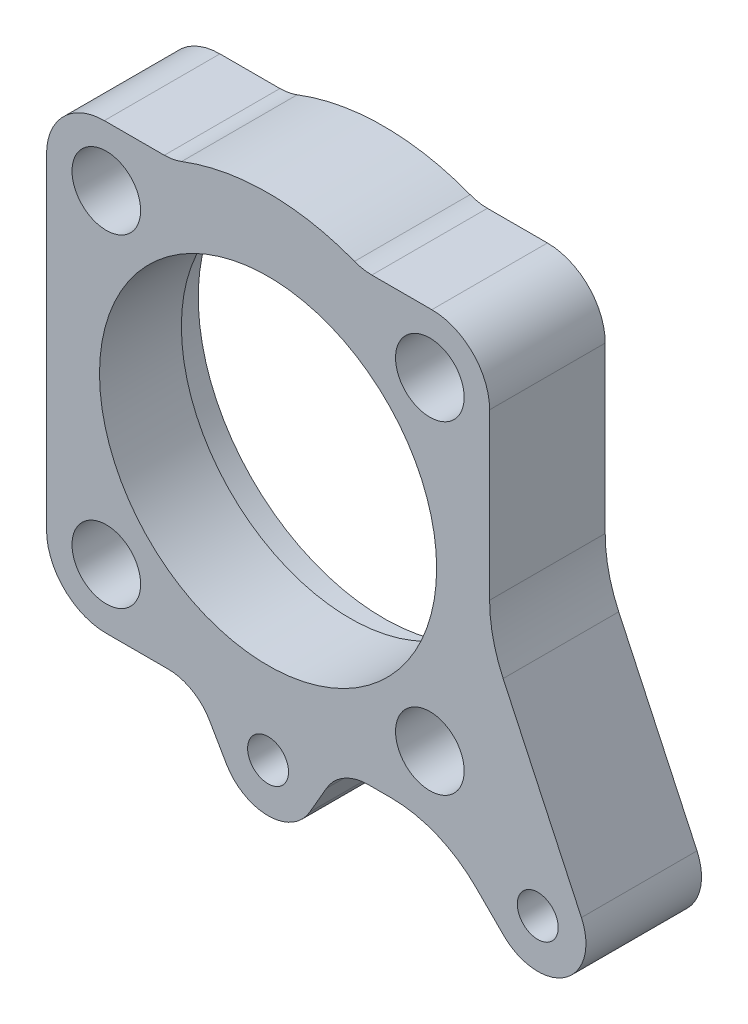
ISO-10303-21;
HEADER;
FILE_DESCRIPTION(('STEP AP214'),'2;1');
FILE_NAME('part.step','',(''),(''),'','','');
FILE_SCHEMA(('AUTOMOTIVE_DESIGN { 1 0 10303 214 1 1 1 1 }'));
ENDSEC;
DATA;
#1=APPLICATION_CONTEXT('core data for automotive mechanical design processes');
#2=APPLICATION_PROTOCOL_DEFINITION('international standard','automotive_design',2000,#1);
#3=PRODUCT_CONTEXT('',#1,'mechanical');
#4=PRODUCT('Part','Part','',(#3));
#5=PRODUCT_RELATED_PRODUCT_CATEGORY('part','',(#4));
#6=PRODUCT_DEFINITION_FORMATION('','',#4);
#7=PRODUCT_DEFINITION_CONTEXT('part definition',#1,'design');
#8=PRODUCT_DEFINITION('design','',#6,#7);
#9=PRODUCT_DEFINITION_SHAPE('','',#8);
#10=(LENGTH_UNIT() NAMED_UNIT(*) SI_UNIT(.MILLI.,.METRE.));
#11=(NAMED_UNIT(*) PLANE_ANGLE_UNIT() SI_UNIT($,.RADIAN.));
#12=(NAMED_UNIT(*) SI_UNIT($,.STERADIAN.) SOLID_ANGLE_UNIT());
#13=UNCERTAINTY_MEASURE_WITH_UNIT(LENGTH_MEASURE(1.E-05),#10,'distance_accuracy_value','');
#14=(GEOMETRIC_REPRESENTATION_CONTEXT(3) GLOBAL_UNCERTAINTY_ASSIGNED_CONTEXT((#13)) GLOBAL_UNIT_ASSIGNED_CONTEXT((#10,
#11,#12)) REPRESENTATION_CONTEXT('',''));
#15=CARTESIAN_POINT('',(0.,0.,0.));
#16=DIRECTION('',(0.,0.,1.));
#17=DIRECTION('',(1.,0.,0.));
#18=AXIS2_PLACEMENT_3D('',#15,#16,#17);
#19=CARTESIAN_POINT('',(0.,-52.,12.));
#20=DIRECTION('',(0.,0.,-1.));
#21=DIRECTION('',(-1.,0.,0.));
#22=AXIS2_PLACEMENT_3D('',#19,#20,#21);
#23=PLANE('',#22);
#24=CARTESIAN_POINT('',(-33.5875721063608,33.5875721063612,12.));
#25=DIRECTION('',(0.,0.,1.));
#26=DIRECTION('',(1.,0.,0.));
#27=AXIS2_PLACEMENT_3D('',#24,#25,#26);
#28=CIRCLE('',#27,7.125);
#29=CARTESIAN_POINT('',(-26.4625721063608,33.5875721063612,12.));
#30=VERTEX_POINT('',#29);
#31=EDGE_CURVE('E655',#30,#30,#28,.T.);
#32=ORIENTED_EDGE('',*,*,#31,.F.);
#33=EDGE_LOOP('',(#32));
#34=FACE_BOUND('',#33,.T.);
#35=CARTESIAN_POINT('',(-33.5875721063608,-33.5875721063612,12.));
#36=DIRECTION('',(0.,0.,1.));
#37=DIRECTION('',(1.,0.,0.));
#38=AXIS2_PLACEMENT_3D('',#35,#36,#37);
#39=CIRCLE('',#38,7.125);
#40=CARTESIAN_POINT('',(-26.4625721063608,-33.5875721063612,12.));
#41=VERTEX_POINT('',#40);
#42=EDGE_CURVE('E657',#41,#41,#39,.T.);
#43=ORIENTED_EDGE('',*,*,#42,.F.);
#44=EDGE_LOOP('',(#43));
#45=FACE_BOUND('',#44,.T.);
#46=CARTESIAN_POINT('',(33.5875721063608,-33.5875721063612,12.));
#47=DIRECTION('',(0.,0.,1.));
#48=DIRECTION('',(1.,0.,0.));
#49=AXIS2_PLACEMENT_3D('',#46,#47,#48);
#50=CIRCLE('',#49,7.125);
#51=CARTESIAN_POINT('',(40.7125721063608,-33.5875721063612,12.));
#52=VERTEX_POINT('',#51);
#53=EDGE_CURVE('E663',#52,#52,#50,.T.);
#54=ORIENTED_EDGE('',*,*,#53,.F.);
#55=EDGE_LOOP('',(#54));
#56=FACE_BOUND('',#55,.T.);
#57=CARTESIAN_POINT('',(33.5875721063607,33.5875721063613,12.));
#58=DIRECTION('',(0.,0.,1.));
#59=DIRECTION('',(1.,0.,0.));
#60=AXIS2_PLACEMENT_3D('',#57,#58,#59);
#61=CIRCLE('',#60,7.12500000000001);
#62=CARTESIAN_POINT('',(40.7125721063607,33.5875721063613,12.));
#63=VERTEX_POINT('',#62);
#64=EDGE_CURVE('E669',#63,#63,#61,.T.);
#65=ORIENTED_EDGE('',*,*,#64,.F.);
#66=EDGE_LOOP('',(#65));
#67=FACE_BOUND('',#66,.T.);
#68=CARTESIAN_POINT('',(56.,-52.,12.));
#69=DIRECTION('',(0.,0.,1.));
#70=DIRECTION('',(1.,0.,0.));
#71=AXIS2_PLACEMENT_3D('',#68,#69,#70);
#72=CIRCLE('',#71,4.25);
#73=CARTESIAN_POINT('',(60.25,-52.,12.));
#74=VERTEX_POINT('',#73);
#75=EDGE_CURVE('E675',#74,#74,#72,.T.);
#76=ORIENTED_EDGE('',*,*,#75,.F.);
#77=EDGE_LOOP('',(#76));
#78=FACE_BOUND('',#77,.T.);
#79=CARTESIAN_POINT('',(0.,-52.,12.));
#80=DIRECTION('',(0.,0.,1.));
#81=DIRECTION('',(1.,0.,0.));
#82=AXIS2_PLACEMENT_3D('',#79,#80,#81);
#83=CIRCLE('',#82,4.25);
#84=CARTESIAN_POINT('',(4.25000000000001,-52.,12.));
#85=VERTEX_POINT('',#84);
#86=EDGE_CURVE('E683',#85,#85,#83,.T.);
#87=ORIENTED_EDGE('',*,*,#86,.F.);
#88=EDGE_LOOP('',(#87));
#89=FACE_BOUND('',#88,.T.);
#90=CARTESIAN_POINT('',(0.,-52.,12.));
#91=DIRECTION('',(0.,0.,-1.));
#92=DIRECTION('',(-1.,0.,0.));
#93=AXIS2_PLACEMENT_3D('',#90,#91,#92);
#94=CIRCLE('',#93,10.);
#95=CARTESIAN_POINT('',(8.66025403784439,-57.,12.));
#96=VERTEX_POINT('',#95);
#97=CARTESIAN_POINT('',(-8.66025403784436,-57.,12.));
#98=VERTEX_POINT('',#97);
#99=EDGE_CURVE('E284',#96,#98,#94,.T.);
#100=ORIENTED_EDGE('',*,*,#99,.F.);
#101=DIRECTION('',(0.5,0.866025403784439,0.));
#102=VECTOR('',#101,1.);
#103=CARTESIAN_POINT('',(8.66025403784439,-57.,12.));
#104=LINE('',#103,#102);
#105=CARTESIAN_POINT('',(12.1243556529819,-51.0000000000005,12.));
#106=VERTEX_POINT('',#105);
#107=EDGE_CURVE('E216',#96,#106,#104,.T.);
#108=ORIENTED_EDGE('',*,*,#107,.T.);
#109=CARTESIAN_POINT('',(20.7846096908263,-56.0000000000005,12.));
#110=DIRECTION('',(0.,0.,1.));
#111=DIRECTION('',(1.,0.,0.));
#112=AXIS2_PLACEMENT_3D('',#109,#110,#111);
#113=CIRCLE('',#112,10.);
#114=CARTESIAN_POINT('',(20.7846096908263,-46.0000000000005,12.));
#115=VERTEX_POINT('',#114);
#116=EDGE_CURVE('E202',#115,#106,#113,.T.);
#117=ORIENTED_EDGE('',*,*,#116,.F.);
#118=DIRECTION('',(-1.,0.,0.));
#119=VECTOR('',#118,1.);
#120=CARTESIAN_POINT('',(25.5025253169422,-46.0000000000006,12.));
#121=LINE('',#120,#119);
#122=CARTESIAN_POINT('',(25.5025253169422,-46.0000000000006,12.));
#123=VERTEX_POINT('',#122);
#124=EDGE_CURVE('E215',#123,#115,#121,.T.);
#125=ORIENTED_EDGE('',*,*,#124,.F.);
#126=CARTESIAN_POINT('',(25.5025253169423,-71.0000000000006,12.));
#127=DIRECTION('',(0.,0.,-1.));
#128=DIRECTION('',(-1.,0.,0.));
#129=AXIS2_PLACEMENT_3D('',#126,#127,#128);
#130=CIRCLE('',#129,25.);
#131=CARTESIAN_POINT('',(43.1801948466059,-53.3223304703368,12.));
#132=VERTEX_POINT('',#131);
#133=EDGE_CURVE('E220',#123,#132,#130,.T.);
#134=ORIENTED_EDGE('',*,*,#133,.T.);
#135=DIRECTION('',(-0.707106781186552,0.707106781186543,0.));
#136=VECTOR('',#135,1.);
#137=CARTESIAN_POINT('',(48.9289321881346,-59.0710678118655,12.));
#138=LINE('',#137,#136);
#139=CARTESIAN_POINT('',(48.9289321881346,-59.0710678118655,12.));
#140=VERTEX_POINT('',#139);
#141=EDGE_CURVE('E222',#140,#132,#138,.T.);
#142=ORIENTED_EDGE('',*,*,#141,.F.);
#143=CARTESIAN_POINT('',(56.,-52.,12.));
#144=DIRECTION('',(0.,0.,-1.));
#145=DIRECTION('',(-1.,0.,0.));
#146=AXIS2_PLACEMENT_3D('',#143,#144,#145);
#147=CIRCLE('',#146,10.);
#148=CARTESIAN_POINT('',(65.0630778703665,-47.773817382593,12.));
#149=VERTEX_POINT('',#148);
#150=EDGE_CURVE('E371',#149,#140,#147,.T.);
#151=ORIENTED_EDGE('',*,*,#150,.F.);
#152=DIRECTION('',(-0.422618261740704,0.906307787036648,0.));
#153=VECTOR('',#152,1.);
#154=CARTESIAN_POINT('',(65.0630778703665,-47.773817382593,12.));
#155=LINE('',#154,#153);
#156=CARTESIAN_POINT('',(48.8107663889006,-12.9206229363128,12.));
#157=VERTEX_POINT('',#156);
#158=EDGE_CURVE('E369',#149,#157,#155,.T.);
#159=ORIENTED_EDGE('',*,*,#158,.T.);
#160=CARTESIAN_POINT('',(76.,-0.242075084091728,12.));
#161=DIRECTION('',(0.,0.,1.));
#162=DIRECTION('',(1.,0.,0.));
#163=AXIS2_PLACEMENT_3D('',#160,#161,#162);
#164=CIRCLE('',#163,30.);
#165=CARTESIAN_POINT('',(46.,-0.242075084091724,12.));
#166=VERTEX_POINT('',#165);
#167=EDGE_CURVE('E366',#166,#157,#164,.T.);
#168=ORIENTED_EDGE('',*,*,#167,.F.);
#169=DIRECTION('',(0.,-1.,0.));
#170=VECTOR('',#169,1.);
#171=CARTESIAN_POINT('',(46.,34.,12.));
#172=LINE('',#171,#170);
#173=CARTESIAN_POINT('',(46.,34.,12.));
#174=VERTEX_POINT('',#173);
#175=EDGE_CURVE('E363',#174,#166,#172,.T.);
#176=ORIENTED_EDGE('',*,*,#175,.F.);
#177=CARTESIAN_POINT('',(34.,34.,12.));
#178=DIRECTION('',(0.,0.,1.));
#179=DIRECTION('',(1.,0.,0.));
#180=AXIS2_PLACEMENT_3D('',#177,#178,#179);
#181=CIRCLE('',#180,12.);
#182=CARTESIAN_POINT('',(34.,46.,12.));
#183=VERTEX_POINT('',#182);
#184=EDGE_CURVE('E361',#174,#183,#181,.T.);
#185=ORIENTED_EDGE('',*,*,#184,.T.);
#186=DIRECTION('',(-1.,0.,0.));
#187=VECTOR('',#186,1.);
#188=CARTESIAN_POINT('',(34.,46.,12.));
#189=LINE('',#188,#187);
#190=CARTESIAN_POINT('',(21.5406592285381,46.,12.));
#191=VERTEX_POINT('',#190);
#192=EDGE_CURVE('E359',#183,#191,#189,.T.);
#193=ORIENTED_EDGE('',*,*,#192,.T.);
#194=CARTESIAN_POINT('',(21.5406592285381,56.,12.));
#195=DIRECTION('',(0.,0.,1.));
#196=DIRECTION('',(1.,0.,0.));
#197=AXIS2_PLACEMENT_3D('',#194,#195,#196);
#198=CIRCLE('',#197,9.99999999999999);
#199=CARTESIAN_POINT('',(17.950549357115,46.6666666666667,12.));
#200=VERTEX_POINT('',#199);
#201=EDGE_CURVE('E356',#200,#191,#198,.T.);
#202=ORIENTED_EDGE('',*,*,#201,.F.);
#203=CARTESIAN_POINT('',(0.,0.,12.));
#204=DIRECTION('',(0.,0.,1.));
#205=DIRECTION('',(1.,0.,0.));
#206=AXIS2_PLACEMENT_3D('',#203,#204,#205);
#207=CIRCLE('',#206,50.);
#208=CARTESIAN_POINT('',(-17.950549357115,46.6666666666667,12.));
#209=VERTEX_POINT('',#208);
#210=EDGE_CURVE('E354',#200,#209,#207,.T.);
#211=ORIENTED_EDGE('',*,*,#210,.T.);
#212=CARTESIAN_POINT('',(-21.5406592285381,56.,12.));
#213=DIRECTION('',(0.,0.,-1.));
#214=DIRECTION('',(-1.,0.,0.));
#215=AXIS2_PLACEMENT_3D('',#212,#213,#214);
#216=CIRCLE('',#215,9.99999999999999);
#217=CARTESIAN_POINT('',(-21.540659228538,46.,12.));
#218=VERTEX_POINT('',#217);
#219=EDGE_CURVE('E352',#209,#218,#216,.T.);
#220=ORIENTED_EDGE('',*,*,#219,.T.);
#221=DIRECTION('',(1.,0.,0.));
#222=VECTOR('',#221,1.);
#223=CARTESIAN_POINT('',(-34.,46.,12.));
#224=LINE('',#223,#222);
#225=CARTESIAN_POINT('',(-34.,46.,12.));
#226=VERTEX_POINT('',#225);
#227=EDGE_CURVE('E349',#226,#218,#224,.T.);
#228=ORIENTED_EDGE('',*,*,#227,.F.);
#229=CARTESIAN_POINT('',(-34.,34.,12.));
#230=DIRECTION('',(0.,0.,-1.));
#231=DIRECTION('',(-1.,0.,0.));
#232=AXIS2_PLACEMENT_3D('',#229,#230,#231);
#233=CIRCLE('',#232,12.);
#234=CARTESIAN_POINT('',(-46.,34.,12.));
#235=VERTEX_POINT('',#234);
#236=EDGE_CURVE('E346',#235,#226,#233,.T.);
#237=ORIENTED_EDGE('',*,*,#236,.F.);
#238=DIRECTION('',(0.,1.,0.));
#239=VECTOR('',#238,1.);
#240=CARTESIAN_POINT('',(-46.,-33.5875721063613,12.));
#241=LINE('',#240,#239);
#242=CARTESIAN_POINT('',(-46.,-33.5875721063613,12.));
#243=VERTEX_POINT('',#242);
#244=EDGE_CURVE('E344',#243,#235,#241,.T.);
#245=ORIENTED_EDGE('',*,*,#244,.F.);
#246=CARTESIAN_POINT('',(-33.5875721063608,-33.5875721063612,12.));
#247=DIRECTION('',(0.,0.,1.));
#248=DIRECTION('',(1.,0.,0.));
#249=AXIS2_PLACEMENT_3D('',#246,#247,#248);
#250=CIRCLE('',#249,12.4124278936392);
#251=CARTESIAN_POINT('',(-33.5875721063607,-46.0000000000004,12.));
#252=VERTEX_POINT('',#251);
#253=EDGE_CURVE('E342',#243,#252,#250,.T.);
#254=ORIENTED_EDGE('',*,*,#253,.T.);
#255=DIRECTION('',(1.,0.,0.));
#256=VECTOR('',#255,1.);
#257=CARTESIAN_POINT('',(-33.5875721063607,-46.0000000000005,12.));
#258=LINE('',#257,#256);
#259=CARTESIAN_POINT('',(-20.7846096908262,-46.0000000000005,12.));
#260=VERTEX_POINT('',#259);
#261=EDGE_CURVE('E340',#252,#260,#258,.T.);
#262=ORIENTED_EDGE('',*,*,#261,.T.);
#263=CARTESIAN_POINT('',(-20.7846096908262,-56.0000000000005,12.));
#264=DIRECTION('',(0.,0.,-1.));
#265=DIRECTION('',(-1.,0.,0.));
#266=AXIS2_PLACEMENT_3D('',#263,#264,#265);
#267=CIRCLE('',#266,9.99999999999997);
#268=CARTESIAN_POINT('',(-12.1243556529819,-51.0000000000005,12.));
#269=VERTEX_POINT('',#268);
#270=EDGE_CURVE('E334',#260,#269,#267,.T.);
#271=ORIENTED_EDGE('',*,*,#270,.T.);
#272=DIRECTION('',(-0.500000000000001,0.866025403784438,0.));
#273=VECTOR('',#272,1.);
#274=CARTESIAN_POINT('',(-8.66025403784436,-57.,12.));
#275=LINE('',#274,#273);
#276=EDGE_CURVE('E332',#98,#269,#275,.T.);
#277=ORIENTED_EDGE('',*,*,#276,.F.);
#278=EDGE_LOOP('',(#100,#108,#117,#125,#134,#142,#151,#159,#168,#176,#185,#193,#202,#211,#220,
#228,#237,#245,#254,#262,#271,#277));
#279=FACE_BOUND('',#278,.T.);
#280=CARTESIAN_POINT('',(0.,0.,12.));
#281=DIRECTION('',(0.,0.,1.));
#282=DIRECTION('',(1.,0.,0.));
#283=AXIS2_PLACEMENT_3D('',#280,#281,#282);
#284=CIRCLE('',#283,35.);
#285=CARTESIAN_POINT('',(35.,0.,12.));
#286=VERTEX_POINT('',#285);
#287=EDGE_CURVE('E231',#286,#286,#284,.T.);
#288=ORIENTED_EDGE('',*,*,#287,.F.);
#289=EDGE_LOOP('',(#288));
#290=FACE_BOUND('',#289,.T.);
#291=ADVANCED_FACE('F45',(#34,#45,#56,#67,#78,#89,#279,#290),#23,.F.);
#292=CARTESIAN_POINT('',(0.,-52.,-12.));
#293=DIRECTION('',(0.,0.,-1.));
#294=DIRECTION('',(-1.,0.,0.));
#295=AXIS2_PLACEMENT_3D('',#292,#293,#294);
#296=PLANE('',#295);
#297=CARTESIAN_POINT('',(-33.5875721063608,33.5875721063612,-12.));
#298=DIRECTION('',(0.,0.,1.));
#299=DIRECTION('',(1.,0.,0.));
#300=AXIS2_PLACEMENT_3D('',#297,#298,#299);
#301=CIRCLE('',#300,7.125);
#302=CARTESIAN_POINT('',(-26.4625721063608,33.5875721063612,-12.));
#303=VERTEX_POINT('',#302);
#304=EDGE_CURVE('E653',#303,#303,#301,.T.);
#305=ORIENTED_EDGE('',*,*,#304,.T.);
#306=EDGE_LOOP('',(#305));
#307=FACE_BOUND('',#306,.T.);
#308=CARTESIAN_POINT('',(-33.5875721063608,-33.5875721063612,-12.));
#309=DIRECTION('',(0.,0.,1.));
#310=DIRECTION('',(1.,0.,0.));
#311=AXIS2_PLACEMENT_3D('',#308,#309,#310);
#312=CIRCLE('',#311,7.125);
#313=CARTESIAN_POINT('',(-26.4625721063608,-33.5875721063612,-12.));
#314=VERTEX_POINT('',#313);
#315=EDGE_CURVE('E660',#314,#314,#312,.T.);
#316=ORIENTED_EDGE('',*,*,#315,.T.);
#317=EDGE_LOOP('',(#316));
#318=FACE_BOUND('',#317,.T.);
#319=CARTESIAN_POINT('',(33.5875721063608,-33.5875721063612,-12.));
#320=DIRECTION('',(0.,0.,1.));
#321=DIRECTION('',(1.,0.,0.));
#322=AXIS2_PLACEMENT_3D('',#319,#320,#321);
#323=CIRCLE('',#322,7.125);
#324=CARTESIAN_POINT('',(40.7125721063608,-33.5875721063612,-12.));
#325=VERTEX_POINT('',#324);
#326=EDGE_CURVE('E666',#325,#325,#323,.T.);
#327=ORIENTED_EDGE('',*,*,#326,.T.);
#328=EDGE_LOOP('',(#327));
#329=FACE_BOUND('',#328,.T.);
#330=CARTESIAN_POINT('',(33.5875721063607,33.5875721063613,-12.));
#331=DIRECTION('',(0.,0.,1.));
#332=DIRECTION('',(1.,0.,0.));
#333=AXIS2_PLACEMENT_3D('',#330,#331,#332);
#334=CIRCLE('',#333,7.12500000000001);
#335=CARTESIAN_POINT('',(40.7125721063607,33.5875721063613,-12.));
#336=VERTEX_POINT('',#335);
#337=EDGE_CURVE('E672',#336,#336,#334,.T.);
#338=ORIENTED_EDGE('',*,*,#337,.T.);
#339=EDGE_LOOP('',(#338));
#340=FACE_BOUND('',#339,.T.);
#341=CARTESIAN_POINT('',(56.,-52.,-12.));
#342=DIRECTION('',(0.,0.,1.));
#343=DIRECTION('',(1.,0.,0.));
#344=AXIS2_PLACEMENT_3D('',#341,#342,#343);
#345=CIRCLE('',#344,4.25);
#346=CARTESIAN_POINT('',(60.25,-52.,-12.));
#347=VERTEX_POINT('',#346);
#348=EDGE_CURVE('E680',#347,#347,#345,.T.);
#349=ORIENTED_EDGE('',*,*,#348,.T.);
#350=EDGE_LOOP('',(#349));
#351=FACE_BOUND('',#350,.T.);
#352=CARTESIAN_POINT('',(0.,-52.,-12.));
#353=DIRECTION('',(0.,0.,1.));
#354=DIRECTION('',(1.,0.,0.));
#355=AXIS2_PLACEMENT_3D('',#352,#353,#354);
#356=CIRCLE('',#355,4.25);
#357=CARTESIAN_POINT('',(4.25000000000001,-52.,-12.));
#358=VERTEX_POINT('',#357);
#359=EDGE_CURVE('E686',#358,#358,#356,.T.);
#360=ORIENTED_EDGE('',*,*,#359,.T.);
#361=EDGE_LOOP('',(#360));
#362=FACE_BOUND('',#361,.T.);
#363=CARTESIAN_POINT('',(0.,-52.,-12.));
#364=DIRECTION('',(0.,0.,-1.));
#365=DIRECTION('',(-1.,0.,0.));
#366=AXIS2_PLACEMENT_3D('',#363,#364,#365);
#367=CIRCLE('',#366,10.);
#368=CARTESIAN_POINT('',(8.66025403784439,-57.,-12.));
#369=VERTEX_POINT('',#368);
#370=CARTESIAN_POINT('',(-8.66025403784436,-57.,-12.));
#371=VERTEX_POINT('',#370);
#372=EDGE_CURVE('E227',#369,#371,#367,.T.);
#373=ORIENTED_EDGE('',*,*,#372,.T.);
#374=DIRECTION('',(-0.500000000000001,0.866025403784438,0.));
#375=VECTOR('',#374,1.);
#376=CARTESIAN_POINT('',(-8.66025403784436,-57.,-12.));
#377=LINE('',#376,#375);
#378=CARTESIAN_POINT('',(-12.1243556529819,-51.0000000000005,-12.));
#379=VERTEX_POINT('',#378);
#380=EDGE_CURVE('E230',#371,#379,#377,.T.);
#381=ORIENTED_EDGE('',*,*,#380,.T.);
#382=CARTESIAN_POINT('',(-20.7846096908262,-56.0000000000005,-12.));
#383=DIRECTION('',(0.,0.,-1.));
#384=DIRECTION('',(-1.,0.,0.));
#385=AXIS2_PLACEMENT_3D('',#382,#383,#384);
#386=CIRCLE('',#385,9.99999999999997);
#387=CARTESIAN_POINT('',(-20.7846096908262,-46.0000000000005,-12.));
#388=VERTEX_POINT('',#387);
#389=EDGE_CURVE('E234',#388,#379,#386,.T.);
#390=ORIENTED_EDGE('',*,*,#389,.F.);
#391=DIRECTION('',(1.,0.,0.));
#392=VECTOR('',#391,1.);
#393=CARTESIAN_POINT('',(-33.5875721063607,-46.0000000000005,-12.));
#394=LINE('',#393,#392);
#395=CARTESIAN_POINT('',(-33.5875721063607,-46.0000000000004,-12.));
#396=VERTEX_POINT('',#395);
#397=EDGE_CURVE('E237',#396,#388,#394,.T.);
#398=ORIENTED_EDGE('',*,*,#397,.F.);
#399=CARTESIAN_POINT('',(-33.5875721063608,-33.5875721063612,-12.));
#400=DIRECTION('',(0.,0.,1.));
#401=DIRECTION('',(1.,0.,0.));
#402=AXIS2_PLACEMENT_3D('',#399,#400,#401);
#403=CIRCLE('',#402,12.4124278936392);
#404=CARTESIAN_POINT('',(-46.,-33.5875721063613,-12.));
#405=VERTEX_POINT('',#404);
#406=EDGE_CURVE('E239',#405,#396,#403,.T.);
#407=ORIENTED_EDGE('',*,*,#406,.F.);
#408=DIRECTION('',(0.,-1.,0.));
#409=VECTOR('',#408,1.);
#410=CARTESIAN_POINT('',(-46.,34.,-12.));
#411=LINE('',#410,#409);
#412=CARTESIAN_POINT('',(-46.,34.,-12.));
#413=VERTEX_POINT('',#412);
#414=EDGE_CURVE('E241',#413,#405,#411,.T.);
#415=ORIENTED_EDGE('',*,*,#414,.F.);
#416=CARTESIAN_POINT('',(-34.,34.,-12.));
#417=DIRECTION('',(0.,0.,-1.));
#418=DIRECTION('',(-1.,0.,0.));
#419=AXIS2_PLACEMENT_3D('',#416,#417,#418);
#420=CIRCLE('',#419,12.);
#421=CARTESIAN_POINT('',(-34.,46.,-12.));
#422=VERTEX_POINT('',#421);
#423=EDGE_CURVE('E243',#413,#422,#420,.T.);
#424=ORIENTED_EDGE('',*,*,#423,.T.);
#425=DIRECTION('',(1.,0.,0.));
#426=VECTOR('',#425,1.);
#427=CARTESIAN_POINT('',(-34.,46.,-12.));
#428=LINE('',#427,#426);
#429=CARTESIAN_POINT('',(-21.540659228538,46.,-12.));
#430=VERTEX_POINT('',#429);
#431=EDGE_CURVE('E246',#422,#430,#428,.T.);
#432=ORIENTED_EDGE('',*,*,#431,.T.);
#433=CARTESIAN_POINT('',(-21.5406592285381,56.,-12.));
#434=DIRECTION('',(0.,0.,-1.));
#435=DIRECTION('',(-1.,0.,0.));
#436=AXIS2_PLACEMENT_3D('',#433,#434,#435);
#437=CIRCLE('',#436,9.99999999999999);
#438=CARTESIAN_POINT('',(-17.950549357115,46.6666666666667,-12.));
#439=VERTEX_POINT('',#438);
#440=EDGE_CURVE('E249',#439,#430,#437,.T.);
#441=ORIENTED_EDGE('',*,*,#440,.F.);
#442=CARTESIAN_POINT('',(0.,0.,-12.));
#443=DIRECTION('',(0.,0.,1.));
#444=DIRECTION('',(1.,0.,0.));
#445=AXIS2_PLACEMENT_3D('',#442,#443,#444);
#446=CIRCLE('',#445,50.);
#447=CARTESIAN_POINT('',(17.950549357115,46.6666666666667,-12.));
#448=VERTEX_POINT('',#447);
#449=EDGE_CURVE('E252',#448,#439,#446,.T.);
#450=ORIENTED_EDGE('',*,*,#449,.F.);
#451=CARTESIAN_POINT('',(21.5406592285381,56.,-12.));
#452=DIRECTION('',(0.,0.,1.));
#453=DIRECTION('',(1.,0.,0.));
#454=AXIS2_PLACEMENT_3D('',#451,#452,#453);
#455=CIRCLE('',#454,9.99999999999999);
#456=CARTESIAN_POINT('',(21.5406592285381,46.,-12.));
#457=VERTEX_POINT('',#456);
#458=EDGE_CURVE('E254',#448,#457,#455,.T.);
#459=ORIENTED_EDGE('',*,*,#458,.T.);
#460=DIRECTION('',(-1.,0.,0.));
#461=VECTOR('',#460,1.);
#462=CARTESIAN_POINT('',(34.,46.,-12.));
#463=LINE('',#462,#461);
#464=CARTESIAN_POINT('',(34.,46.,-12.));
#465=VERTEX_POINT('',#464);
#466=EDGE_CURVE('E257',#465,#457,#463,.T.);
#467=ORIENTED_EDGE('',*,*,#466,.F.);
#468=CARTESIAN_POINT('',(34.,34.,-12.));
#469=DIRECTION('',(0.,0.,1.));
#470=DIRECTION('',(1.,0.,0.));
#471=AXIS2_PLACEMENT_3D('',#468,#469,#470);
#472=CIRCLE('',#471,12.);
#473=CARTESIAN_POINT('',(46.,34.,-12.));
#474=VERTEX_POINT('',#473);
#475=EDGE_CURVE('E260',#474,#465,#472,.T.);
#476=ORIENTED_EDGE('',*,*,#475,.F.);
#477=DIRECTION('',(0.,-1.,0.));
#478=VECTOR('',#477,1.);
#479=CARTESIAN_POINT('',(46.,34.,-12.));
#480=LINE('',#479,#478);
#481=CARTESIAN_POINT('',(46.,-0.242075084091724,-12.));
#482=VERTEX_POINT('',#481);
#483=EDGE_CURVE('E262',#474,#482,#480,.T.);
#484=ORIENTED_EDGE('',*,*,#483,.T.);
#485=CARTESIAN_POINT('',(76.,-0.242075084091728,-12.));
#486=DIRECTION('',(0.,0.,1.));
#487=DIRECTION('',(1.,0.,0.));
#488=AXIS2_PLACEMENT_3D('',#485,#486,#487);
#489=CIRCLE('',#488,30.);
#490=CARTESIAN_POINT('',(48.8107663889006,-12.9206229363128,-12.));
#491=VERTEX_POINT('',#490);
#492=EDGE_CURVE('E265',#482,#491,#489,.T.);
#493=ORIENTED_EDGE('',*,*,#492,.T.);
#494=DIRECTION('',(-0.422618261740704,0.906307787036648,0.));
#495=VECTOR('',#494,1.);
#496=CARTESIAN_POINT('',(65.0630778703665,-47.773817382593,-12.));
#497=LINE('',#496,#495);
#498=CARTESIAN_POINT('',(65.0630778703665,-47.773817382593,-12.));
#499=VERTEX_POINT('',#498);
#500=EDGE_CURVE('E268',#499,#491,#497,.T.);
#501=ORIENTED_EDGE('',*,*,#500,.F.);
#502=CARTESIAN_POINT('',(56.,-52.,-12.));
#503=DIRECTION('',(0.,0.,-1.));
#504=DIRECTION('',(-1.,0.,0.));
#505=AXIS2_PLACEMENT_3D('',#502,#503,#504);
#506=CIRCLE('',#505,10.);
#507=CARTESIAN_POINT('',(48.9289321881346,-59.0710678118655,-12.));
#508=VERTEX_POINT('',#507);
#509=EDGE_CURVE('E271',#499,#508,#506,.T.);
#510=ORIENTED_EDGE('',*,*,#509,.T.);
#511=DIRECTION('',(-0.707106781186552,0.707106781186543,0.));
#512=VECTOR('',#511,1.);
#513=CARTESIAN_POINT('',(48.9289321881346,-59.0710678118655,-12.));
#514=LINE('',#513,#512);
#515=CARTESIAN_POINT('',(43.1801948466059,-53.3223304703368,-12.));
#516=VERTEX_POINT('',#515);
#517=EDGE_CURVE('E274',#508,#516,#514,.T.);
#518=ORIENTED_EDGE('',*,*,#517,.T.);
#519=CARTESIAN_POINT('',(25.5025253169423,-71.0000000000006,-12.));
#520=DIRECTION('',(0.,0.,-1.));
#521=DIRECTION('',(-1.,0.,0.));
#522=AXIS2_PLACEMENT_3D('',#519,#520,#521);
#523=CIRCLE('',#522,25.);
#524=CARTESIAN_POINT('',(25.5025253169422,-46.0000000000006,-12.));
#525=VERTEX_POINT('',#524);
#526=EDGE_CURVE('E277',#525,#516,#523,.T.);
#527=ORIENTED_EDGE('',*,*,#526,.F.);
#528=DIRECTION('',(-1.,0.,0.));
#529=VECTOR('',#528,1.);
#530=CARTESIAN_POINT('',(25.5025253169422,-46.0000000000006,-12.));
#531=LINE('',#530,#529);
#532=CARTESIAN_POINT('',(20.7846096908263,-46.0000000000005,-12.));
#533=VERTEX_POINT('',#532);
#534=EDGE_CURVE('E280',#525,#533,#531,.T.);
#535=ORIENTED_EDGE('',*,*,#534,.T.);
#536=CARTESIAN_POINT('',(20.7846096908263,-56.0000000000005,-12.));
#537=DIRECTION('',(0.,0.,1.));
#538=DIRECTION('',(1.,0.,0.));
#539=AXIS2_PLACEMENT_3D('',#536,#537,#538);
#540=CIRCLE('',#539,10.);
#541=CARTESIAN_POINT('',(12.1243556529819,-51.0000000000005,-12.));
#542=VERTEX_POINT('',#541);
#543=EDGE_CURVE('E204',#533,#542,#540,.T.);
#544=ORIENTED_EDGE('',*,*,#543,.T.);
#545=DIRECTION('',(0.5,0.866025403784439,0.));
#546=VECTOR('',#545,1.);
#547=CARTESIAN_POINT('',(8.66025403784439,-57.,-12.));
#548=LINE('',#547,#546);
#549=EDGE_CURVE('E283',#369,#542,#548,.T.);
#550=ORIENTED_EDGE('',*,*,#549,.F.);
#551=EDGE_LOOP('',(#373,#381,#390,#398,#407,#415,#424,#432,#441,#450,#459,#467,#476,#484,#493,
#501,#510,#518,#527,#535,#544,#550));
#552=FACE_BOUND('',#551,.T.);
#553=CARTESIAN_POINT('',(0.,0.,-12.));
#554=DIRECTION('',(0.,0.,1.));
#555=DIRECTION('',(1.,0.,0.));
#556=AXIS2_PLACEMENT_3D('',#553,#554,#555);
#557=CIRCLE('',#556,38.5);
#558=CARTESIAN_POINT('',(38.5,0.,-12.));
#559=VERTEX_POINT('',#558);
#560=EDGE_CURVE('E689',#559,#559,#557,.T.);
#561=ORIENTED_EDGE('',*,*,#560,.T.);
#562=EDGE_LOOP('',(#561));
#563=FACE_BOUND('',#562,.T.);
#564=ADVANCED_FACE('F329',(#307,#318,#329,#340,#351,#362,#552,#563),#296,.T.);
#565=CARTESIAN_POINT('',(0.,-52.,12.));
#566=DIRECTION('',(0.,0.,-1.));
#567=DIRECTION('',(-1.,0.,0.));
#568=AXIS2_PLACEMENT_3D('',#565,#566,#567);
#569=CYLINDRICAL_SURFACE('',#568,10.);
#570=ORIENTED_EDGE('',*,*,#372,.F.);
#571=DIRECTION('',(0.,0.,-1.));
#572=VECTOR('',#571,1.);
#573=CARTESIAN_POINT('',(8.66025403784439,-57.,12.));
#574=LINE('',#573,#572);
#575=EDGE_CURVE('E11',#96,#369,#574,.T.);
#576=ORIENTED_EDGE('',*,*,#575,.F.);
#577=ORIENTED_EDGE('',*,*,#99,.T.);
#578=DIRECTION('',(0.,0.,-1.));
#579=VECTOR('',#578,1.);
#580=CARTESIAN_POINT('',(-8.66025403784436,-57.,12.));
#581=LINE('',#580,#579);
#582=EDGE_CURVE('E49',#98,#371,#581,.T.);
#583=ORIENTED_EDGE('',*,*,#582,.T.);
#584=EDGE_LOOP('',(#570,#576,#577,#583));
#585=FACE_BOUND('',#584,.T.);
#586=ADVANCED_FACE('F47',(#585),#569,.T.);
#587=CARTESIAN_POINT('',(8.66025403784439,-57.,12.));
#588=DIRECTION('',(-0.866025403784439,0.5,0.));
#589=DIRECTION('',(-0.5,-0.866025403784439,0.));
#590=AXIS2_PLACEMENT_3D('',#587,#588,#589);
#591=PLANE('',#590);
#592=ORIENTED_EDGE('',*,*,#549,.T.);
#593=DIRECTION('',(0.,0.,-1.));
#594=VECTOR('',#593,1.);
#595=CARTESIAN_POINT('',(12.1243556529819,-51.0000000000005,12.));
#596=LINE('',#595,#594);
#597=EDGE_CURVE('E55',#106,#542,#596,.T.);
#598=ORIENTED_EDGE('',*,*,#597,.F.);
#599=ORIENTED_EDGE('',*,*,#107,.F.);
#600=ORIENTED_EDGE('',*,*,#575,.T.);
#601=EDGE_LOOP('',(#592,#598,#599,#600));
#602=FACE_BOUND('',#601,.T.);
#603=ADVANCED_FACE('F331',(#602),#591,.F.);
#604=CARTESIAN_POINT('',(20.7846096908263,-56.0000000000005,12.));
#605=DIRECTION('',(0.,0.,-1.));
#606=DIRECTION('',(-1.,0.,0.));
#607=AXIS2_PLACEMENT_3D('',#604,#605,#606);
#608=CYLINDRICAL_SURFACE('',#607,10.);
#609=ORIENTED_EDGE('',*,*,#543,.F.);
#610=DIRECTION('',(0.,0.,-1.));
#611=VECTOR('',#610,1.);
#612=CARTESIAN_POINT('',(20.7846096908263,-46.0000000000005,12.));
#613=LINE('',#612,#611);
#614=EDGE_CURVE('E199',#115,#533,#613,.T.);
#615=ORIENTED_EDGE('',*,*,#614,.F.);
#616=ORIENTED_EDGE('',*,*,#116,.T.);
#617=ORIENTED_EDGE('',*,*,#597,.T.);
#618=EDGE_LOOP('',(#609,#615,#616,#617));
#619=FACE_BOUND('',#618,.T.);
#620=ADVANCED_FACE('F201',(#619),#608,.F.);
#621=CARTESIAN_POINT('',(25.5025253169422,-46.0000000000006,12.));
#622=DIRECTION('',(0.,-1.,0.));
#623=DIRECTION('',(1.,0.,0.));
#624=AXIS2_PLACEMENT_3D('',#621,#622,#623);
#625=PLANE('',#624);
#626=ORIENTED_EDGE('',*,*,#534,.F.);
#627=DIRECTION('',(0.,0.,-1.));
#628=VECTOR('',#627,1.);
#629=CARTESIAN_POINT('',(25.5025253169422,-46.0000000000006,12.));
#630=LINE('',#629,#628);
#631=EDGE_CURVE('E209',#123,#525,#630,.T.);
#632=ORIENTED_EDGE('',*,*,#631,.F.);
#633=ORIENTED_EDGE('',*,*,#124,.T.);
#634=ORIENTED_EDGE('',*,*,#614,.T.);
#635=EDGE_LOOP('',(#626,#632,#633,#634));
#636=FACE_BOUND('',#635,.T.);
#637=ADVANCED_FACE('F218',(#636),#625,.T.);
#638=CARTESIAN_POINT('',(25.5025253169423,-71.0000000000006,12.));
#639=DIRECTION('',(0.,0.,-1.));
#640=DIRECTION('',(-1.,0.,0.));
#641=AXIS2_PLACEMENT_3D('',#638,#639,#640);
#642=CYLINDRICAL_SURFACE('',#641,25.);
#643=ORIENTED_EDGE('',*,*,#526,.T.);
#644=DIRECTION('',(0.,0.,-1.));
#645=VECTOR('',#644,1.);
#646=CARTESIAN_POINT('',(43.1801948466059,-53.3223304703368,12.));
#647=LINE('',#646,#645);
#648=EDGE_CURVE('E288',#132,#516,#647,.T.);
#649=ORIENTED_EDGE('',*,*,#648,.F.);
#650=ORIENTED_EDGE('',*,*,#133,.F.);
#651=ORIENTED_EDGE('',*,*,#631,.T.);
#652=EDGE_LOOP('',(#643,#649,#650,#651));
#653=FACE_BOUND('',#652,.T.);
#654=ADVANCED_FACE('F475',(#653),#642,.F.);
#655=CARTESIAN_POINT('',(48.9289321881346,-59.0710678118655,12.));
#656=DIRECTION('',(-0.707106781186543,-0.707106781186552,0.));
#657=DIRECTION('',(0.707106781186552,-0.707106781186543,0.));
#658=AXIS2_PLACEMENT_3D('',#655,#656,#657);
#659=PLANE('',#658);
#660=ORIENTED_EDGE('',*,*,#517,.F.);
#661=DIRECTION('',(0.,0.,-1.));
#662=VECTOR('',#661,1.);
#663=CARTESIAN_POINT('',(48.9289321881346,-59.0710678118655,12.));
#664=LINE('',#663,#662);
#665=EDGE_CURVE('E290',#140,#508,#664,.T.);
#666=ORIENTED_EDGE('',*,*,#665,.F.);
#667=ORIENTED_EDGE('',*,*,#141,.T.);
#668=ORIENTED_EDGE('',*,*,#648,.T.);
#669=EDGE_LOOP('',(#660,#666,#667,#668));
#670=FACE_BOUND('',#669,.T.);
#671=ADVANCED_FACE('F377',(#670),#659,.T.);
#672=CARTESIAN_POINT('',(56.,-52.,12.));
#673=DIRECTION('',(0.,0.,-1.));
#674=DIRECTION('',(-1.,0.,0.));
#675=AXIS2_PLACEMENT_3D('',#672,#673,#674);
#676=CYLINDRICAL_SURFACE('',#675,10.);
#677=ORIENTED_EDGE('',*,*,#509,.F.);
#678=DIRECTION('',(0.,0.,-1.));
#679=VECTOR('',#678,1.);
#680=CARTESIAN_POINT('',(65.0630778703665,-47.773817382593,12.));
#681=LINE('',#680,#679);
#682=EDGE_CURVE('E292',#149,#499,#681,.T.);
#683=ORIENTED_EDGE('',*,*,#682,.F.);
#684=ORIENTED_EDGE('',*,*,#150,.T.);
#685=ORIENTED_EDGE('',*,*,#665,.T.);
#686=EDGE_LOOP('',(#677,#683,#684,#685));
#687=FACE_BOUND('',#686,.T.);
#688=ADVANCED_FACE('F382',(#687),#676,.T.);
#689=CARTESIAN_POINT('',(65.0630778703665,-47.773817382593,12.));
#690=DIRECTION('',(-0.906307787036648,-0.422618261740704,0.));
#691=DIRECTION('',(0.422618261740704,-0.906307787036648,0.));
#692=AXIS2_PLACEMENT_3D('',#689,#690,#691);
#693=PLANE('',#692);
#694=ORIENTED_EDGE('',*,*,#500,.T.);
#695=DIRECTION('',(0.,0.,-1.));
#696=VECTOR('',#695,1.);
#697=CARTESIAN_POINT('',(48.8107663889006,-12.9206229363128,12.));
#698=LINE('',#697,#696);
#699=EDGE_CURVE('E294',#157,#491,#698,.T.);
#700=ORIENTED_EDGE('',*,*,#699,.F.);
#701=ORIENTED_EDGE('',*,*,#158,.F.);
#702=ORIENTED_EDGE('',*,*,#682,.T.);
#703=EDGE_LOOP('',(#694,#700,#701,#702));
#704=FACE_BOUND('',#703,.T.);
#705=ADVANCED_FACE('F387',(#704),#693,.F.);
#706=CARTESIAN_POINT('',(76.,-0.242075084091728,12.));
#707=DIRECTION('',(0.,0.,-1.));
#708=DIRECTION('',(-1.,0.,0.));
#709=AXIS2_PLACEMENT_3D('',#706,#707,#708);
#710=CYLINDRICAL_SURFACE('',#709,30.);
#711=ORIENTED_EDGE('',*,*,#492,.F.);
#712=DIRECTION('',(0.,0.,-1.));
#713=VECTOR('',#712,1.);
#714=CARTESIAN_POINT('',(46.,-0.242075084091724,12.));
#715=LINE('',#714,#713);
#716=EDGE_CURVE('E296',#166,#482,#715,.T.);
#717=ORIENTED_EDGE('',*,*,#716,.F.);
#718=ORIENTED_EDGE('',*,*,#167,.T.);
#719=ORIENTED_EDGE('',*,*,#699,.T.);
#720=EDGE_LOOP('',(#711,#717,#718,#719));
#721=FACE_BOUND('',#720,.T.);
#722=ADVANCED_FACE('F445',(#721),#710,.F.);
#723=CARTESIAN_POINT('',(46.,34.,12.));
#724=DIRECTION('',(1.,0.,0.));
#725=DIRECTION('',(0.,1.,0.));
#726=AXIS2_PLACEMENT_3D('',#723,#724,#725);
#727=PLANE('',#726);
#728=ORIENTED_EDGE('',*,*,#483,.F.);
#729=DIRECTION('',(0.,0.,-1.));
#730=VECTOR('',#729,1.);
#731=CARTESIAN_POINT('',(46.,34.,12.));
#732=LINE('',#731,#730);
#733=EDGE_CURVE('E298',#174,#474,#732,.T.);
#734=ORIENTED_EDGE('',*,*,#733,.F.);
#735=ORIENTED_EDGE('',*,*,#175,.T.);
#736=ORIENTED_EDGE('',*,*,#716,.T.);
#737=EDGE_LOOP('',(#728,#734,#735,#736));
#738=FACE_BOUND('',#737,.T.);
#739=ADVANCED_FACE('F393',(#738),#727,.T.);
#740=CARTESIAN_POINT('',(34.,34.,12.));
#741=DIRECTION('',(0.,0.,-1.));
#742=DIRECTION('',(-1.,0.,0.));
#743=AXIS2_PLACEMENT_3D('',#740,#741,#742);
#744=CYLINDRICAL_SURFACE('',#743,12.);
#745=ORIENTED_EDGE('',*,*,#475,.T.);
#746=DIRECTION('',(0.,0.,-1.));
#747=VECTOR('',#746,1.);
#748=CARTESIAN_POINT('',(34.,46.,12.));
#749=LINE('',#748,#747);
#750=EDGE_CURVE('E300',#183,#465,#749,.T.);
#751=ORIENTED_EDGE('',*,*,#750,.F.);
#752=ORIENTED_EDGE('',*,*,#184,.F.);
#753=ORIENTED_EDGE('',*,*,#733,.T.);
#754=EDGE_LOOP('',(#745,#751,#752,#753));
#755=FACE_BOUND('',#754,.T.);
#756=ADVANCED_FACE('F399',(#755),#744,.T.);
#757=CARTESIAN_POINT('',(34.,46.,12.));
#758=DIRECTION('',(0.,-1.,0.));
#759=DIRECTION('',(1.,0.,0.));
#760=AXIS2_PLACEMENT_3D('',#757,#758,#759);
#761=PLANE('',#760);
#762=ORIENTED_EDGE('',*,*,#466,.T.);
#763=DIRECTION('',(0.,0.,-1.));
#764=VECTOR('',#763,1.);
#765=CARTESIAN_POINT('',(21.5406592285381,46.,12.));
#766=LINE('',#765,#764);
#767=EDGE_CURVE('E303',#191,#457,#766,.T.);
#768=ORIENTED_EDGE('',*,*,#767,.F.);
#769=ORIENTED_EDGE('',*,*,#192,.F.);
#770=ORIENTED_EDGE('',*,*,#750,.T.);
#771=EDGE_LOOP('',(#762,#768,#769,#770));
#772=FACE_BOUND('',#771,.T.);
#773=ADVANCED_FACE('F404',(#772),#761,.F.);
#774=CARTESIAN_POINT('',(21.5406592285381,56.,12.));
#775=DIRECTION('',(0.,0.,-1.));
#776=DIRECTION('',(-1.,0.,0.));
#777=AXIS2_PLACEMENT_3D('',#774,#775,#776);
#778=CYLINDRICAL_SURFACE('',#777,9.99999999999999);
#779=ORIENTED_EDGE('',*,*,#458,.F.);
#780=DIRECTION('',(0.,0.,-1.));
#781=VECTOR('',#780,1.);
#782=CARTESIAN_POINT('',(17.950549357115,46.6666666666667,12.));
#783=LINE('',#782,#781);
#784=EDGE_CURVE('E305',#200,#448,#783,.T.);
#785=ORIENTED_EDGE('',*,*,#784,.F.);
#786=ORIENTED_EDGE('',*,*,#201,.T.);
#787=ORIENTED_EDGE('',*,*,#767,.T.);
#788=EDGE_LOOP('',(#779,#785,#786,#787));
#789=FACE_BOUND('',#788,.T.);
#790=ADVANCED_FACE('F408',(#789),#778,.F.);
#791=CARTESIAN_POINT('',(0.,0.,12.));
#792=DIRECTION('',(0.,0.,-1.));
#793=DIRECTION('',(-1.,0.,0.));
#794=AXIS2_PLACEMENT_3D('',#791,#792,#793);
#795=CYLINDRICAL_SURFACE('',#794,50.);
#796=ORIENTED_EDGE('',*,*,#449,.T.);
#797=DIRECTION('',(0.,0.,-1.));
#798=VECTOR('',#797,1.);
#799=CARTESIAN_POINT('',(-17.950549357115,46.6666666666667,12.));
#800=LINE('',#799,#798);
#801=EDGE_CURVE('E307',#209,#439,#800,.T.);
#802=ORIENTED_EDGE('',*,*,#801,.F.);
#803=ORIENTED_EDGE('',*,*,#210,.F.);
#804=ORIENTED_EDGE('',*,*,#784,.T.);
#805=EDGE_LOOP('',(#796,#802,#803,#804));
#806=FACE_BOUND('',#805,.T.);
#807=ADVANCED_FACE('F413',(#806),#795,.T.);
#808=CARTESIAN_POINT('',(-21.5406592285381,56.,12.));
#809=DIRECTION('',(0.,0.,-1.));
#810=DIRECTION('',(-1.,0.,0.));
#811=AXIS2_PLACEMENT_3D('',#808,#809,#810);
#812=CYLINDRICAL_SURFACE('',#811,9.99999999999999);
#813=ORIENTED_EDGE('',*,*,#440,.T.);
#814=DIRECTION('',(0.,0.,-1.));
#815=VECTOR('',#814,1.);
#816=CARTESIAN_POINT('',(-21.540659228538,46.,12.));
#817=LINE('',#816,#815);
#818=EDGE_CURVE('E310',#218,#430,#817,.T.);
#819=ORIENTED_EDGE('',*,*,#818,.F.);
#820=ORIENTED_EDGE('',*,*,#219,.F.);
#821=ORIENTED_EDGE('',*,*,#801,.T.);
#822=EDGE_LOOP('',(#813,#819,#820,#821));
#823=FACE_BOUND('',#822,.T.);
#824=ADVANCED_FACE('F419',(#823),#812,.F.);
#825=CARTESIAN_POINT('',(-34.,46.,12.));
#826=DIRECTION('',(0.,1.,0.));
#827=DIRECTION('',(-1.,0.,0.));
#828=AXIS2_PLACEMENT_3D('',#825,#826,#827);
#829=PLANE('',#828);
#830=ORIENTED_EDGE('',*,*,#431,.F.);
#831=DIRECTION('',(0.,0.,-1.));
#832=VECTOR('',#831,1.);
#833=CARTESIAN_POINT('',(-34.,46.,12.));
#834=LINE('',#833,#832);
#835=EDGE_CURVE('E312',#226,#422,#834,.T.);
#836=ORIENTED_EDGE('',*,*,#835,.F.);
#837=ORIENTED_EDGE('',*,*,#227,.T.);
#838=ORIENTED_EDGE('',*,*,#818,.T.);
#839=EDGE_LOOP('',(#830,#836,#837,#838));
#840=FACE_BOUND('',#839,.T.);
#841=ADVANCED_FACE('F423',(#840),#829,.T.);
#842=CARTESIAN_POINT('',(-34.,34.,12.));
#843=DIRECTION('',(0.,0.,-1.));
#844=DIRECTION('',(-1.,0.,0.));
#845=AXIS2_PLACEMENT_3D('',#842,#843,#844);
#846=CYLINDRICAL_SURFACE('',#845,12.);
#847=ORIENTED_EDGE('',*,*,#423,.F.);
#848=DIRECTION('',(0.,0.,-1.));
#849=VECTOR('',#848,1.);
#850=CARTESIAN_POINT('',(-46.,34.,12.));
#851=LINE('',#850,#849);
#852=EDGE_CURVE('E314',#235,#413,#851,.T.);
#853=ORIENTED_EDGE('',*,*,#852,.F.);
#854=ORIENTED_EDGE('',*,*,#236,.T.);
#855=ORIENTED_EDGE('',*,*,#835,.T.);
#856=EDGE_LOOP('',(#847,#853,#854,#855));
#857=FACE_BOUND('',#856,.T.);
#858=ADVANCED_FACE('F426',(#857),#846,.T.);
#859=CARTESIAN_POINT('',(-46.,34.,12.));
#860=DIRECTION('',(1.,0.,0.));
#861=DIRECTION('',(0.,1.,0.));
#862=AXIS2_PLACEMENT_3D('',#859,#860,#861);
#863=PLANE('',#862);
#864=ORIENTED_EDGE('',*,*,#414,.T.);
#865=DIRECTION('',(0.,0.,-1.));
#866=VECTOR('',#865,1.);
#867=CARTESIAN_POINT('',(-46.,-33.5875721063613,12.));
#868=LINE('',#867,#866);
#869=EDGE_CURVE('E316',#243,#405,#868,.T.);
#870=ORIENTED_EDGE('',*,*,#869,.F.);
#871=ORIENTED_EDGE('',*,*,#244,.T.);
#872=ORIENTED_EDGE('',*,*,#852,.T.);
#873=EDGE_LOOP('',(#864,#870,#871,#872));
#874=FACE_BOUND('',#873,.T.);
#875=ADVANCED_FACE('F432',(#874),#863,.F.);
#876=CARTESIAN_POINT('',(-33.5875721063608,-33.5875721063612,12.));
#877=DIRECTION('',(0.,0.,-1.));
#878=DIRECTION('',(-1.,0.,0.));
#879=AXIS2_PLACEMENT_3D('',#876,#877,#878);
#880=CYLINDRICAL_SURFACE('',#879,12.4124278936392);
#881=ORIENTED_EDGE('',*,*,#406,.T.);
#882=DIRECTION('',(0.,0.,-1.));
#883=VECTOR('',#882,1.);
#884=CARTESIAN_POINT('',(-33.5875721063607,-46.0000000000004,12.));
#885=LINE('',#884,#883);
#886=EDGE_CURVE('E319',#252,#396,#885,.T.);
#887=ORIENTED_EDGE('',*,*,#886,.F.);
#888=ORIENTED_EDGE('',*,*,#253,.F.);
#889=ORIENTED_EDGE('',*,*,#869,.T.);
#890=EDGE_LOOP('',(#881,#887,#888,#889));
#891=FACE_BOUND('',#890,.T.);
#892=ADVANCED_FACE('F436',(#891),#880,.T.);
#893=CARTESIAN_POINT('',(-33.5875721063607,-46.0000000000005,12.));
#894=DIRECTION('',(0.,1.,0.));
#895=DIRECTION('',(-1.,0.,0.));
#896=AXIS2_PLACEMENT_3D('',#893,#894,#895);
#897=PLANE('',#896);
#898=ORIENTED_EDGE('',*,*,#397,.T.);
#899=DIRECTION('',(0.,0.,-1.));
#900=VECTOR('',#899,1.);
#901=CARTESIAN_POINT('',(-20.7846096908262,-46.0000000000005,12.));
#902=LINE('',#901,#900);
#903=EDGE_CURVE('E322',#260,#388,#902,.T.);
#904=ORIENTED_EDGE('',*,*,#903,.F.);
#905=ORIENTED_EDGE('',*,*,#261,.F.);
#906=ORIENTED_EDGE('',*,*,#886,.T.);
#907=EDGE_LOOP('',(#898,#904,#905,#906));
#908=FACE_BOUND('',#907,.T.);
#909=ADVANCED_FACE('F441',(#908),#897,.F.);
#910=CARTESIAN_POINT('',(-20.7846096908262,-56.0000000000005,12.));
#911=DIRECTION('',(0.,0.,-1.));
#912=DIRECTION('',(-1.,0.,0.));
#913=AXIS2_PLACEMENT_3D('',#910,#911,#912);
#914=CYLINDRICAL_SURFACE('',#913,9.99999999999997);
#915=ORIENTED_EDGE('',*,*,#389,.T.);
#916=DIRECTION('',(0.,0.,-1.));
#917=VECTOR('',#916,1.);
#918=CARTESIAN_POINT('',(-12.1243556529819,-51.0000000000005,12.));
#919=LINE('',#918,#917);
#920=EDGE_CURVE('E324',#269,#379,#919,.T.);
#921=ORIENTED_EDGE('',*,*,#920,.F.);
#922=ORIENTED_EDGE('',*,*,#270,.F.);
#923=ORIENTED_EDGE('',*,*,#903,.T.);
#924=EDGE_LOOP('',(#915,#921,#922,#923));
#925=FACE_BOUND('',#924,.T.);
#926=ADVANCED_FACE('F444',(#925),#914,.F.);
#927=CARTESIAN_POINT('',(-8.66025403784436,-57.,12.));
#928=DIRECTION('',(-0.866025403784438,-0.500000000000001,0.));
#929=DIRECTION('',(0.500000000000001,-0.866025403784438,0.));
#930=AXIS2_PLACEMENT_3D('',#927,#928,#929);
#931=PLANE('',#930);
#932=ORIENTED_EDGE('',*,*,#380,.F.);
#933=ORIENTED_EDGE('',*,*,#582,.F.);
#934=ORIENTED_EDGE('',*,*,#276,.T.);
#935=ORIENTED_EDGE('',*,*,#920,.T.);
#936=EDGE_LOOP('',(#932,#933,#934,#935));
#937=FACE_BOUND('',#936,.T.);
#938=ADVANCED_FACE('F326',(#937),#931,.T.);
#939=CARTESIAN_POINT('',(0.,0.,0.));
#940=DIRECTION('',(0.,0.,1.));
#941=DIRECTION('',(1.,0.,0.));
#942=AXIS2_PLACEMENT_3D('',#939,#940,#941);
#943=CYLINDRICAL_SURFACE('',#942,35.);
#944=ORIENTED_EDGE('',*,*,#287,.T.);
#945=EDGE_LOOP('',(#944));
#946=FACE_BOUND('',#945,.T.);
#947=CARTESIAN_POINT('',(0.,0.,-5.));
#948=DIRECTION('',(0.,0.,1.));
#949=DIRECTION('',(1.,0.,0.));
#950=AXIS2_PLACEMENT_3D('',#947,#948,#949);
#951=CIRCLE('',#950,35.);
#952=CARTESIAN_POINT('',(35.,0.,-5.));
#953=VERTEX_POINT('',#952);
#954=EDGE_CURVE('E694',#953,#953,#951,.T.);
#955=ORIENTED_EDGE('',*,*,#954,.F.);
#956=EDGE_LOOP('',(#955));
#957=FACE_BOUND('',#956,.T.);
#958=ADVANCED_FACE('F466',(#946,#957),#943,.F.);
#959=CARTESIAN_POINT('',(0.,38.5,-5.));
#960=DIRECTION('',(0.,0.,-1.));
#961=DIRECTION('',(-1.,0.,0.));
#962=AXIS2_PLACEMENT_3D('',#959,#960,#961);
#963=PLANE('',#962);
#964=ORIENTED_EDGE('',*,*,#954,.T.);
#965=EDGE_LOOP('',(#964));
#966=FACE_BOUND('',#965,.T.);
#967=CARTESIAN_POINT('',(0.,0.,-5.));
#968=DIRECTION('',(0.,0.,1.));
#969=DIRECTION('',(1.,0.,0.));
#970=AXIS2_PLACEMENT_3D('',#967,#968,#969);
#971=CIRCLE('',#970,38.5);
#972=CARTESIAN_POINT('',(38.5,0.,-5.));
#973=VERTEX_POINT('',#972);
#974=EDGE_CURVE('E692',#973,#973,#971,.T.);
#975=ORIENTED_EDGE('',*,*,#974,.F.);
#976=EDGE_LOOP('',(#975));
#977=FACE_BOUND('',#976,.T.);
#978=ADVANCED_FACE('F584',(#966,#977),#963,.T.);
#979=CARTESIAN_POINT('',(0.,0.,0.));
#980=DIRECTION('',(0.,0.,1.));
#981=DIRECTION('',(1.,0.,0.));
#982=AXIS2_PLACEMENT_3D('',#979,#980,#981);
#983=CYLINDRICAL_SURFACE('',#982,38.5);
#984=ORIENTED_EDGE('',*,*,#974,.T.);
#985=EDGE_LOOP('',(#984));
#986=FACE_BOUND('',#985,.T.);
#987=ORIENTED_EDGE('',*,*,#560,.F.);
#988=EDGE_LOOP('',(#987));
#989=FACE_BOUND('',#988,.T.);
#990=ADVANCED_FACE('F591',(#986,#989),#983,.F.);
#991=CARTESIAN_POINT('',(0.,-52.,12.));
#992=DIRECTION('',(0.,0.,1.));
#993=DIRECTION('',(1.,0.,0.));
#994=AXIS2_PLACEMENT_3D('',#991,#992,#993);
#995=CYLINDRICAL_SURFACE('',#994,4.25);
#996=ORIENTED_EDGE('',*,*,#359,.F.);
#997=EDGE_LOOP('',(#996));
#998=FACE_BOUND('',#997,.T.);
#999=ORIENTED_EDGE('',*,*,#86,.T.);
#1000=EDGE_LOOP('',(#999));
#1001=FACE_BOUND('',#1000,.T.);
#1002=ADVANCED_FACE('F598',(#998,#1001),#995,.F.);
#1003=CARTESIAN_POINT('',(56.,-52.,12.));
#1004=DIRECTION('',(0.,0.,1.));
#1005=DIRECTION('',(1.,0.,0.));
#1006=AXIS2_PLACEMENT_3D('',#1003,#1004,#1005);
#1007=CYLINDRICAL_SURFACE('',#1006,4.25);
#1008=ORIENTED_EDGE('',*,*,#348,.F.);
#1009=EDGE_LOOP('',(#1008));
#1010=FACE_BOUND('',#1009,.T.);
#1011=ORIENTED_EDGE('',*,*,#75,.T.);
#1012=EDGE_LOOP('',(#1011));
#1013=FACE_BOUND('',#1012,.T.);
#1014=ADVANCED_FACE('F607',(#1010,#1013),#1007,.F.);
#1015=CARTESIAN_POINT('',(33.5875721063607,33.5875721063613,-12.));
#1016=DIRECTION('',(0.,0.,1.));
#1017=DIRECTION('',(1.,0.,0.));
#1018=AXIS2_PLACEMENT_3D('',#1015,#1016,#1017);
#1019=CYLINDRICAL_SURFACE('',#1018,7.12500000000001);
#1020=ORIENTED_EDGE('',*,*,#337,.F.);
#1021=EDGE_LOOP('',(#1020));
#1022=FACE_BOUND('',#1021,.T.);
#1023=ORIENTED_EDGE('',*,*,#64,.T.);
#1024=EDGE_LOOP('',(#1023));
#1025=FACE_BOUND('',#1024,.T.);
#1026=ADVANCED_FACE('F616',(#1022,#1025),#1019,.F.);
#1027=CARTESIAN_POINT('',(33.5875721063608,-33.5875721063612,-12.));
#1028=DIRECTION('',(0.,0.,1.));
#1029=DIRECTION('',(1.,0.,0.));
#1030=AXIS2_PLACEMENT_3D('',#1027,#1028,#1029);
#1031=CYLINDRICAL_SURFACE('',#1030,7.125);
#1032=ORIENTED_EDGE('',*,*,#326,.F.);
#1033=EDGE_LOOP('',(#1032));
#1034=FACE_BOUND('',#1033,.T.);
#1035=ORIENTED_EDGE('',*,*,#53,.T.);
#1036=EDGE_LOOP('',(#1035));
#1037=FACE_BOUND('',#1036,.T.);
#1038=ADVANCED_FACE('F624',(#1034,#1037),#1031,.F.);
#1039=CARTESIAN_POINT('',(-33.5875721063608,-33.5875721063612,-12.));
#1040=DIRECTION('',(0.,0.,1.));
#1041=DIRECTION('',(1.,0.,0.));
#1042=AXIS2_PLACEMENT_3D('',#1039,#1040,#1041);
#1043=CYLINDRICAL_SURFACE('',#1042,7.125);
#1044=ORIENTED_EDGE('',*,*,#315,.F.);
#1045=EDGE_LOOP('',(#1044));
#1046=FACE_BOUND('',#1045,.T.);
#1047=ORIENTED_EDGE('',*,*,#42,.T.);
#1048=EDGE_LOOP('',(#1047));
#1049=FACE_BOUND('',#1048,.T.);
#1050=ADVANCED_FACE('F632',(#1046,#1049),#1043,.F.);
#1051=CARTESIAN_POINT('',(-33.5875721063608,33.5875721063612,-12.));
#1052=DIRECTION('',(0.,0.,1.));
#1053=DIRECTION('',(1.,0.,0.));
#1054=AXIS2_PLACEMENT_3D('',#1051,#1052,#1053);
#1055=CYLINDRICAL_SURFACE('',#1054,7.125);
#1056=ORIENTED_EDGE('',*,*,#304,.F.);
#1057=EDGE_LOOP('',(#1056));
#1058=FACE_BOUND('',#1057,.T.);
#1059=ORIENTED_EDGE('',*,*,#31,.T.);
#1060=EDGE_LOOP('',(#1059));
#1061=FACE_BOUND('',#1060,.T.);
#1062=ADVANCED_FACE('F640',(#1058,#1061),#1055,.F.);
#1063=CLOSED_SHELL('',(#291,#564,#586,#603,#620,#637,#654,#671,#688,#705,#722,#739,#756,#773,
#790,#807,#824,#841,#858,#875,#892,#909,#926,#938,#958,#978,#990,#1002,#1014,#1026,#1038,#1050,#1062));
#1064=MANIFOLD_SOLID_BREP('B2',#1063);
#1065=ADVANCED_BREP_SHAPE_REPRESENTATION('',(#18,#1064),#14);
#1066=SHAPE_DEFINITION_REPRESENTATION(#9,#1065);
ENDSEC;
END-ISO-10303-21;
